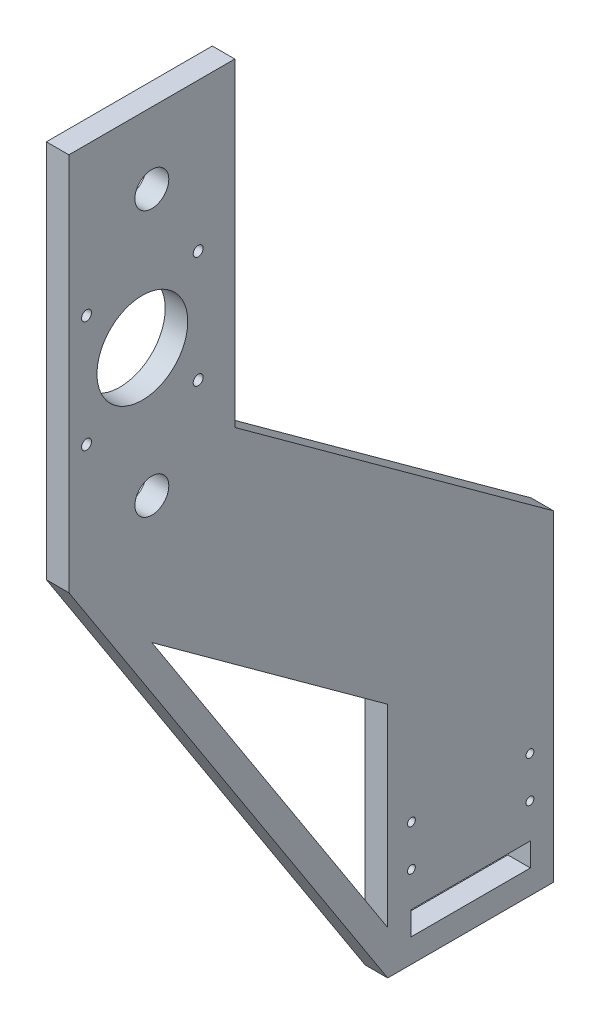
ISO-10303-21;
HEADER;
FILE_DESCRIPTION(('STEP AP214'),'2;1');
FILE_NAME('part.step','',(''),(''),'','','');
FILE_SCHEMA(('AUTOMOTIVE_DESIGN { 1 0 10303 214 1 1 1 1 }'));
ENDSEC;
DATA;
#1=APPLICATION_CONTEXT('core data for automotive mechanical design processes');
#2=APPLICATION_PROTOCOL_DEFINITION('international standard','automotive_design',2000,#1);
#3=PRODUCT_CONTEXT('',#1,'mechanical');
#4=PRODUCT('Part','Part','',(#3));
#5=PRODUCT_RELATED_PRODUCT_CATEGORY('part','',(#4));
#6=PRODUCT_DEFINITION_FORMATION('','',#4);
#7=PRODUCT_DEFINITION_CONTEXT('part definition',#1,'design');
#8=PRODUCT_DEFINITION('design','',#6,#7);
#9=PRODUCT_DEFINITION_SHAPE('','',#8);
#10=(LENGTH_UNIT() NAMED_UNIT(*) SI_UNIT(.MILLI.,.METRE.));
#11=(NAMED_UNIT(*) PLANE_ANGLE_UNIT() SI_UNIT($,.RADIAN.));
#12=(NAMED_UNIT(*) SI_UNIT($,.STERADIAN.) SOLID_ANGLE_UNIT());
#13=UNCERTAINTY_MEASURE_WITH_UNIT(LENGTH_MEASURE(1.E-05),#10,'distance_accuracy_value','');
#14=(GEOMETRIC_REPRESENTATION_CONTEXT(3) GLOBAL_UNCERTAINTY_ASSIGNED_CONTEXT((#13)) GLOBAL_UNIT_ASSIGNED_CONTEXT((#10,
#11,#12)) REPRESENTATION_CONTEXT('',''));
#15=CARTESIAN_POINT('',(0.,0.,0.));
#16=DIRECTION('',(0.,0.,1.));
#17=DIRECTION('',(1.,0.,0.));
#18=AXIS2_PLACEMENT_3D('',#15,#16,#17);
#19=CARTESIAN_POINT('',(9.5,0.,0.));
#20=DIRECTION('',(1.,0.,0.));
#21=DIRECTION('',(0.,0.,-1.));
#22=AXIS2_PLACEMENT_3D('',#19,#20,#21);
#23=PLANE('',#22);
#24=CARTESIAN_POINT('',(9.5,305.55,127.05));
#25=DIRECTION('',(1.,0.,0.));
#26=DIRECTION('',(0.,0.,-1.));
#27=AXIS2_PLACEMENT_3D('',#24,#25,#26);
#28=CIRCLE('',#27,2.09999999999999);
#29=CARTESIAN_POINT('',(9.5,305.55,124.95));
#30=VERTEX_POINT('',#29);
#31=EDGE_CURVE('E445',#30,#30,#28,.T.);
#32=ORIENTED_EDGE('',*,*,#31,.F.);
#33=EDGE_LOOP('',(#32));
#34=FACE_BOUND('',#33,.T.);
#35=CARTESIAN_POINT('',(9.5,305.55,79.95));
#36=DIRECTION('',(1.,0.,0.));
#37=DIRECTION('',(0.,0.,-1.));
#38=AXIS2_PLACEMENT_3D('',#35,#36,#37);
#39=CIRCLE('',#38,2.09999999999999);
#40=CARTESIAN_POINT('',(9.5,305.55,77.85));
#41=VERTEX_POINT('',#40);
#42=EDGE_CURVE('E449',#41,#41,#39,.T.);
#43=ORIENTED_EDGE('',*,*,#42,.F.);
#44=EDGE_LOOP('',(#43));
#45=FACE_BOUND('',#44,.T.);
#46=CARTESIAN_POINT('',(9.5,258.45,79.9499999999995));
#47=DIRECTION('',(1.,0.,0.));
#48=DIRECTION('',(0.,0.,-1.));
#49=AXIS2_PLACEMENT_3D('',#46,#47,#48);
#50=CIRCLE('',#49,2.09999999999999);
#51=CARTESIAN_POINT('',(9.5,258.45,77.8499999999995));
#52=VERTEX_POINT('',#51);
#53=EDGE_CURVE('E459',#52,#52,#50,.T.);
#54=ORIENTED_EDGE('',*,*,#53,.F.);
#55=EDGE_LOOP('',(#54));
#56=FACE_BOUND('',#55,.T.);
#57=CARTESIAN_POINT('',(9.5,258.45,127.049999999999));
#58=DIRECTION('',(1.,0.,0.));
#59=DIRECTION('',(0.,0.,-1.));
#60=AXIS2_PLACEMENT_3D('',#57,#58,#59);
#61=CIRCLE('',#60,2.09999999999999);
#62=CARTESIAN_POINT('',(9.5,258.45,124.95));
#63=VERTEX_POINT('',#62);
#64=EDGE_CURVE('E467',#63,#63,#61,.T.);
#65=ORIENTED_EDGE('',*,*,#64,.F.);
#66=EDGE_LOOP('',(#65));
#67=FACE_BOUND('',#66,.T.);
#68=CARTESIAN_POINT('',(9.5,34.7,-10.));
#69=DIRECTION('',(1.,0.,0.));
#70=DIRECTION('',(0.,0.,-1.));
#71=AXIS2_PLACEMENT_3D('',#68,#69,#70);
#72=CIRCLE('',#71,1.65);
#73=CARTESIAN_POINT('',(9.5,34.7,-11.65));
#74=VERTEX_POINT('',#73);
#75=EDGE_CURVE('E475',#74,#74,#72,.T.);
#76=ORIENTED_EDGE('',*,*,#75,.F.);
#77=EDGE_LOOP('',(#76));
#78=FACE_BOUND('',#77,.T.);
#79=CARTESIAN_POINT('',(9.5,52.,-10.));
#80=DIRECTION('',(1.,0.,0.));
#81=DIRECTION('',(0.,0.,-1.));
#82=AXIS2_PLACEMENT_3D('',#79,#80,#81);
#83=CIRCLE('',#82,1.65);
#84=CARTESIAN_POINT('',(9.5,52.,-11.65));
#85=VERTEX_POINT('',#84);
#86=EDGE_CURVE('E483',#85,#85,#83,.T.);
#87=ORIENTED_EDGE('',*,*,#86,.F.);
#88=EDGE_LOOP('',(#87));
#89=FACE_BOUND('',#88,.T.);
#90=CARTESIAN_POINT('',(9.5,52.,-60.));
#91=DIRECTION('',(1.,0.,0.));
#92=DIRECTION('',(0.,0.,-1.));
#93=AXIS2_PLACEMENT_3D('',#90,#91,#92);
#94=CIRCLE('',#93,1.65);
#95=CARTESIAN_POINT('',(9.5,52.,-61.65));
#96=VERTEX_POINT('',#95);
#97=EDGE_CURVE('E491',#96,#96,#94,.T.);
#98=ORIENTED_EDGE('',*,*,#97,.F.);
#99=EDGE_LOOP('',(#98));
#100=FACE_BOUND('',#99,.T.);
#101=CARTESIAN_POINT('',(9.5,34.7,-60.));
#102=DIRECTION('',(1.,0.,0.));
#103=DIRECTION('',(0.,0.,-1.));
#104=AXIS2_PLACEMENT_3D('',#101,#102,#103);
#105=CIRCLE('',#104,1.65);
#106=CARTESIAN_POINT('',(9.5,34.7,-61.65));
#107=VERTEX_POINT('',#106);
#108=EDGE_CURVE('E499',#107,#107,#105,.T.);
#109=ORIENTED_EDGE('',*,*,#108,.F.);
#110=EDGE_LOOP('',(#109));
#111=FACE_BOUND('',#110,.T.);
#112=CARTESIAN_POINT('',(9.5,226.,99.5));
#113=DIRECTION('',(1.,0.,0.));
#114=DIRECTION('',(0.,0.,-1.));
#115=AXIS2_PLACEMENT_3D('',#112,#113,#114);
#116=CIRCLE('',#115,7.15);
#117=CARTESIAN_POINT('',(9.5,226.,92.35));
#118=VERTEX_POINT('',#117);
#119=EDGE_CURVE('E203',#118,#118,#116,.T.);
#120=ORIENTED_EDGE('',*,*,#119,.F.);
#121=EDGE_LOOP('',(#120));
#122=FACE_BOUND('',#121,.T.);
#123=DIRECTION('',(0.,0.587779000342478,0.809021536645594));
#124=VECTOR('',#123,1.);
#125=CARTESIAN_POINT('',(9.5,172.289806741815,99.5));
#126=LINE('',#125,#124);
#127=CARTESIAN_POINT('',(9.5,100.,0.));
#128=VERTEX_POINT('',#127);
#129=CARTESIAN_POINT('',(9.5,172.289806741815,99.4999999999999));
#130=VERTEX_POINT('',#129);
#131=EDGE_CURVE('E222',#128,#130,#126,.T.);
#132=ORIENTED_EDGE('',*,*,#131,.F.);
#133=DIRECTION('',(0.,1.,0.));
#134=VECTOR('',#133,1.);
#135=CARTESIAN_POINT('',(9.5,100.,0.));
#136=LINE('',#135,#134);
#137=CARTESIAN_POINT('',(9.5,18.4162007938601,0.));
#138=VERTEX_POINT('',#137);
#139=EDGE_CURVE('E219',#138,#128,#136,.T.);
#140=ORIENTED_EDGE('',*,*,#139,.F.);
#141=DIRECTION('',(0.,-0.839732591318498,-0.543000161213163));
#142=VECTOR('',#141,1.);
#143=CARTESIAN_POINT('',(9.5,18.4162007938601,0.));
#144=LINE('',#143,#142);
#145=EDGE_CURVE('E227',#130,#138,#144,.T.);
#146=ORIENTED_EDGE('',*,*,#145,.F.);
#147=EDGE_LOOP('',(#132,#140,#146));
#148=FACE_BOUND('',#147,.T.);
#149=DIRECTION('',(0.,-0.839732591318498,-0.543000161213163));
#150=VECTOR('',#149,1.);
#151=CARTESIAN_POINT('',(9.5,208.,134.5));
#152=LINE('',#151,#150);
#153=CARTESIAN_POINT('',(9.5,208.,134.5));
#154=VERTEX_POINT('',#153);
#155=CARTESIAN_POINT('',(9.5,0.,0.));
#156=VERTEX_POINT('',#155);
#157=EDGE_CURVE('E252',#154,#156,#152,.T.);
#158=ORIENTED_EDGE('',*,*,#157,.T.);
#159=DIRECTION('',(0.,0.,-1.));
#160=VECTOR('',#159,1.);
#161=CARTESIAN_POINT('',(9.5,0.,0.));
#162=LINE('',#161,#160);
#163=CARTESIAN_POINT('',(9.5,0.,-70.));
#164=VERTEX_POINT('',#163);
#165=EDGE_CURVE('E256',#156,#164,#162,.T.);
#166=ORIENTED_EDGE('',*,*,#165,.T.);
#167=DIRECTION('',(0.,1.,0.));
#168=VECTOR('',#167,1.);
#169=CARTESIAN_POINT('',(9.5,0.,-70.));
#170=LINE('',#169,#168);
#171=CARTESIAN_POINT('',(9.5,135.667122158044,-70.));
#172=VERTEX_POINT('',#171);
#173=EDGE_CURVE('E260',#164,#172,#170,.T.);
#174=ORIENTED_EDGE('',*,*,#173,.T.);
#175=DIRECTION('',(0.,0.587779000342478,0.809021536645594));
#176=VECTOR('',#175,1.);
#177=CARTESIAN_POINT('',(9.5,135.667122158044,-70.));
#178=LINE('',#177,#176);
#179=CARTESIAN_POINT('',(9.5,233.385504135674,64.5));
#180=VERTEX_POINT('',#179);
#181=EDGE_CURVE('E263',#172,#180,#178,.T.);
#182=ORIENTED_EDGE('',*,*,#181,.T.);
#183=DIRECTION('',(0.,1.,0.));
#184=VECTOR('',#183,1.);
#185=CARTESIAN_POINT('',(9.5,233.385504135674,64.5));
#186=LINE('',#185,#184);
#187=CARTESIAN_POINT('',(9.5,368.,64.5));
#188=VERTEX_POINT('',#187);
#189=EDGE_CURVE('E266',#180,#188,#186,.T.);
#190=ORIENTED_EDGE('',*,*,#189,.T.);
#191=DIRECTION('',(0.,0.,1.));
#192=VECTOR('',#191,1.);
#193=CARTESIAN_POINT('',(9.5,368.,64.5));
#194=LINE('',#193,#192);
#195=CARTESIAN_POINT('',(9.5,368.,134.5));
#196=VERTEX_POINT('',#195);
#197=EDGE_CURVE('E269',#188,#196,#194,.T.);
#198=ORIENTED_EDGE('',*,*,#197,.T.);
#199=DIRECTION('',(0.,-1.,0.));
#200=VECTOR('',#199,1.);
#201=CARTESIAN_POINT('',(9.5,368.,134.5));
#202=LINE('',#201,#200);
#203=EDGE_CURVE('E272',#196,#154,#202,.T.);
#204=ORIENTED_EDGE('',*,*,#203,.T.);
#205=EDGE_LOOP('',(#158,#166,#174,#182,#190,#198,#204));
#206=FACE_BOUND('',#205,.T.);
#207=CARTESIAN_POINT('',(9.5,338.,99.5));
#208=DIRECTION('',(1.,0.,0.));
#209=DIRECTION('',(0.,0.,-1.));
#210=AXIS2_PLACEMENT_3D('',#207,#208,#209);
#211=CIRCLE('',#210,7.15000000000001);
#212=CARTESIAN_POINT('',(9.5,338.,92.35));
#213=VERTEX_POINT('',#212);
#214=EDGE_CURVE('E211',#213,#213,#211,.T.);
#215=ORIENTED_EDGE('',*,*,#214,.F.);
#216=EDGE_LOOP('',(#215));
#217=FACE_BOUND('',#216,.T.);
#218=CARTESIAN_POINT('',(9.5,282.,103.5));
#219=DIRECTION('',(1.,0.,0.));
#220=DIRECTION('',(0.,0.,-1.));
#221=AXIS2_PLACEMENT_3D('',#218,#219,#220);
#222=CIRCLE('',#221,19.15);
#223=CARTESIAN_POINT('',(9.5,282.,84.35));
#224=VERTEX_POINT('',#223);
#225=EDGE_CURVE('E195',#224,#224,#222,.T.);
#226=ORIENTED_EDGE('',*,*,#225,.F.);
#227=EDGE_LOOP('',(#226));
#228=FACE_BOUND('',#227,.T.);
#229=DIRECTION('',(0.,0.,-1.));
#230=VECTOR('',#229,1.);
#231=CARTESIAN_POINT('',(9.5,10.1,-9.8));
#232=LINE('',#231,#230);
#233=CARTESIAN_POINT('',(9.5,10.1,-9.8));
#234=VERTEX_POINT('',#233);
#235=CARTESIAN_POINT('',(9.5,10.1,-60.2));
#236=VERTEX_POINT('',#235);
#237=EDGE_CURVE('E154',#234,#236,#232,.T.);
#238=ORIENTED_EDGE('',*,*,#237,.F.);
#239=DIRECTION('',(0.,-1.,0.));
#240=VECTOR('',#239,1.);
#241=CARTESIAN_POINT('',(9.5,20.,-9.8));
#242=LINE('',#241,#240);
#243=CARTESIAN_POINT('',(9.5,20.,-9.8));
#244=VERTEX_POINT('',#243);
#245=EDGE_CURVE('E145',#244,#234,#242,.T.);
#246=ORIENTED_EDGE('',*,*,#245,.F.);
#247=DIRECTION('',(0.,0.,1.));
#248=VECTOR('',#247,1.);
#249=CARTESIAN_POINT('',(9.5,20.,-9.8));
#250=LINE('',#249,#248);
#251=CARTESIAN_POINT('',(9.5,20.,-60.2));
#252=VERTEX_POINT('',#251);
#253=EDGE_CURVE('E171',#252,#244,#250,.T.);
#254=ORIENTED_EDGE('',*,*,#253,.F.);
#255=DIRECTION('',(0.,1.,0.));
#256=VECTOR('',#255,1.);
#257=CARTESIAN_POINT('',(9.5,20.,-60.2));
#258=LINE('',#257,#256);
#259=EDGE_CURVE('E167',#236,#252,#258,.T.);
#260=ORIENTED_EDGE('',*,*,#259,.F.);
#261=EDGE_LOOP('',(#238,#246,#254,#260));
#262=FACE_BOUND('',#261,.T.);
#263=ADVANCED_FACE('F43',(#34,#45,#56,#67,#78,#89,#100,#111,#122,#148,#206,#217,#228,#262),#23,.T.);
#264=CARTESIAN_POINT('',(0.,0.,0.));
#265=DIRECTION('',(1.,0.,0.));
#266=DIRECTION('',(0.,0.,-1.));
#267=AXIS2_PLACEMENT_3D('',#264,#265,#266);
#268=PLANE('',#267);
#269=CARTESIAN_POINT('',(0.,305.55,127.05));
#270=DIRECTION('',(1.,0.,0.));
#271=DIRECTION('',(0.,0.,-1.));
#272=AXIS2_PLACEMENT_3D('',#269,#270,#271);
#273=CIRCLE('',#272,2.09999999999999);
#274=CARTESIAN_POINT('',(0.,305.55,124.95));
#275=VERTEX_POINT('',#274);
#276=EDGE_CURVE('E443',#275,#275,#273,.T.);
#277=ORIENTED_EDGE('',*,*,#276,.T.);
#278=EDGE_LOOP('',(#277));
#279=FACE_BOUND('',#278,.T.);
#280=CARTESIAN_POINT('',(0.,305.55,79.95));
#281=DIRECTION('',(1.,0.,0.));
#282=DIRECTION('',(0.,0.,-1.));
#283=AXIS2_PLACEMENT_3D('',#280,#281,#282);
#284=CIRCLE('',#283,2.09999999999999);
#285=CARTESIAN_POINT('',(0.,305.55,77.85));
#286=VERTEX_POINT('',#285);
#287=EDGE_CURVE('E455',#286,#286,#284,.T.);
#288=ORIENTED_EDGE('',*,*,#287,.T.);
#289=EDGE_LOOP('',(#288));
#290=FACE_BOUND('',#289,.T.);
#291=CARTESIAN_POINT('',(0.,258.45,79.9499999999995));
#292=DIRECTION('',(1.,0.,0.));
#293=DIRECTION('',(0.,0.,-1.));
#294=AXIS2_PLACEMENT_3D('',#291,#292,#293);
#295=CIRCLE('',#294,2.09999999999999);
#296=CARTESIAN_POINT('',(0.,258.45,77.8499999999995));
#297=VERTEX_POINT('',#296);
#298=EDGE_CURVE('E463',#297,#297,#295,.T.);
#299=ORIENTED_EDGE('',*,*,#298,.T.);
#300=EDGE_LOOP('',(#299));
#301=FACE_BOUND('',#300,.T.);
#302=CARTESIAN_POINT('',(0.,258.45,127.049999999999));
#303=DIRECTION('',(1.,0.,0.));
#304=DIRECTION('',(0.,0.,-1.));
#305=AXIS2_PLACEMENT_3D('',#302,#303,#304);
#306=CIRCLE('',#305,2.09999999999999);
#307=CARTESIAN_POINT('',(0.,258.45,124.95));
#308=VERTEX_POINT('',#307);
#309=EDGE_CURVE('E471',#308,#308,#306,.T.);
#310=ORIENTED_EDGE('',*,*,#309,.T.);
#311=EDGE_LOOP('',(#310));
#312=FACE_BOUND('',#311,.T.);
#313=CARTESIAN_POINT('',(0.,34.7,-10.));
#314=DIRECTION('',(1.,0.,0.));
#315=DIRECTION('',(0.,0.,-1.));
#316=AXIS2_PLACEMENT_3D('',#313,#314,#315);
#317=CIRCLE('',#316,1.65);
#318=CARTESIAN_POINT('',(0.,34.7,-11.65));
#319=VERTEX_POINT('',#318);
#320=EDGE_CURVE('E479',#319,#319,#317,.T.);
#321=ORIENTED_EDGE('',*,*,#320,.T.);
#322=EDGE_LOOP('',(#321));
#323=FACE_BOUND('',#322,.T.);
#324=CARTESIAN_POINT('',(0.,52.,-10.));
#325=DIRECTION('',(1.,0.,0.));
#326=DIRECTION('',(0.,0.,-1.));
#327=AXIS2_PLACEMENT_3D('',#324,#325,#326);
#328=CIRCLE('',#327,1.65);
#329=CARTESIAN_POINT('',(0.,52.,-11.65));
#330=VERTEX_POINT('',#329);
#331=EDGE_CURVE('E487',#330,#330,#328,.T.);
#332=ORIENTED_EDGE('',*,*,#331,.T.);
#333=EDGE_LOOP('',(#332));
#334=FACE_BOUND('',#333,.T.);
#335=CARTESIAN_POINT('',(0.,52.,-60.));
#336=DIRECTION('',(1.,0.,0.));
#337=DIRECTION('',(0.,0.,-1.));
#338=AXIS2_PLACEMENT_3D('',#335,#336,#337);
#339=CIRCLE('',#338,1.65);
#340=CARTESIAN_POINT('',(0.,52.,-61.65));
#341=VERTEX_POINT('',#340);
#342=EDGE_CURVE('E495',#341,#341,#339,.T.);
#343=ORIENTED_EDGE('',*,*,#342,.T.);
#344=EDGE_LOOP('',(#343));
#345=FACE_BOUND('',#344,.T.);
#346=CARTESIAN_POINT('',(0.,34.7,-60.));
#347=DIRECTION('',(1.,0.,0.));
#348=DIRECTION('',(0.,0.,-1.));
#349=AXIS2_PLACEMENT_3D('',#346,#347,#348);
#350=CIRCLE('',#349,1.65);
#351=CARTESIAN_POINT('',(0.,34.7,-61.65));
#352=VERTEX_POINT('',#351);
#353=EDGE_CURVE('E179',#352,#352,#350,.T.);
#354=ORIENTED_EDGE('',*,*,#353,.T.);
#355=EDGE_LOOP('',(#354));
#356=FACE_BOUND('',#355,.T.);
#357=CARTESIAN_POINT('',(0.,282.,103.5));
#358=DIRECTION('',(1.,0.,0.));
#359=DIRECTION('',(0.,0.,-1.));
#360=AXIS2_PLACEMENT_3D('',#357,#358,#359);
#361=CIRCLE('',#360,19.15);
#362=CARTESIAN_POINT('',(0.,282.,84.35));
#363=VERTEX_POINT('',#362);
#364=EDGE_CURVE('E163',#363,#363,#361,.T.);
#365=ORIENTED_EDGE('',*,*,#364,.T.);
#366=EDGE_LOOP('',(#365));
#367=FACE_BOUND('',#366,.T.);
#368=CARTESIAN_POINT('',(0.,226.,99.5));
#369=DIRECTION('',(1.,0.,0.));
#370=DIRECTION('',(0.,0.,-1.));
#371=AXIS2_PLACEMENT_3D('',#368,#369,#370);
#372=CIRCLE('',#371,7.15);
#373=CARTESIAN_POINT('',(0.,226.,92.35));
#374=VERTEX_POINT('',#373);
#375=EDGE_CURVE('E199',#374,#374,#372,.T.);
#376=ORIENTED_EDGE('',*,*,#375,.T.);
#377=EDGE_LOOP('',(#376));
#378=FACE_BOUND('',#377,.T.);
#379=CARTESIAN_POINT('',(0.,338.,99.5));
#380=DIRECTION('',(1.,0.,0.));
#381=DIRECTION('',(0.,0.,-1.));
#382=AXIS2_PLACEMENT_3D('',#379,#380,#381);
#383=CIRCLE('',#382,7.15000000000001);
#384=CARTESIAN_POINT('',(0.,338.,92.35));
#385=VERTEX_POINT('',#384);
#386=EDGE_CURVE('E207',#385,#385,#383,.T.);
#387=ORIENTED_EDGE('',*,*,#386,.T.);
#388=EDGE_LOOP('',(#387));
#389=FACE_BOUND('',#388,.T.);
#390=DIRECTION('',(0.,1.,0.));
#391=VECTOR('',#390,1.);
#392=CARTESIAN_POINT('',(0.,100.,0.));
#393=LINE('',#392,#391);
#394=CARTESIAN_POINT('',(0.,18.4162007938601,0.));
#395=VERTEX_POINT('',#394);
#396=CARTESIAN_POINT('',(0.,100.,0.));
#397=VERTEX_POINT('',#396);
#398=EDGE_CURVE('E215',#395,#397,#393,.T.);
#399=ORIENTED_EDGE('',*,*,#398,.T.);
#400=DIRECTION('',(0.,0.587779000342478,0.809021536645594));
#401=VECTOR('',#400,1.);
#402=CARTESIAN_POINT('',(0.,172.289806741815,99.5));
#403=LINE('',#402,#401);
#404=CARTESIAN_POINT('',(0.,172.289806741815,99.5));
#405=VERTEX_POINT('',#404);
#406=EDGE_CURVE('E234',#397,#405,#403,.T.);
#407=ORIENTED_EDGE('',*,*,#406,.T.);
#408=DIRECTION('',(0.,-0.839732591318498,-0.543000161213163));
#409=VECTOR('',#408,1.);
#410=CARTESIAN_POINT('',(0.,18.4162007938601,0.));
#411=LINE('',#410,#409);
#412=EDGE_CURVE('E223',#405,#395,#411,.T.);
#413=ORIENTED_EDGE('',*,*,#412,.T.);
#414=EDGE_LOOP('',(#399,#407,#413));
#415=FACE_BOUND('',#414,.T.);
#416=DIRECTION('',(0.,-0.839732591318498,-0.543000161213163));
#417=VECTOR('',#416,1.);
#418=CARTESIAN_POINT('',(0.,208.,134.5));
#419=LINE('',#418,#417);
#420=CARTESIAN_POINT('',(0.,208.,134.5));
#421=VERTEX_POINT('',#420);
#422=CARTESIAN_POINT('',(0.,0.,0.));
#423=VERTEX_POINT('',#422);
#424=EDGE_CURVE('E251',#421,#423,#419,.T.);
#425=ORIENTED_EDGE('',*,*,#424,.F.);
#426=DIRECTION('',(0.,-1.,0.));
#427=VECTOR('',#426,1.);
#428=CARTESIAN_POINT('',(0.,368.,134.5));
#429=LINE('',#428,#427);
#430=CARTESIAN_POINT('',(0.,368.,134.5));
#431=VERTEX_POINT('',#430);
#432=EDGE_CURVE('E257',#431,#421,#429,.T.);
#433=ORIENTED_EDGE('',*,*,#432,.F.);
#434=DIRECTION('',(0.,0.,1.));
#435=VECTOR('',#434,1.);
#436=CARTESIAN_POINT('',(0.,368.,64.5));
#437=LINE('',#436,#435);
#438=CARTESIAN_POINT('',(0.,368.,64.5));
#439=VERTEX_POINT('',#438);
#440=EDGE_CURVE('E291',#439,#431,#437,.T.);
#441=ORIENTED_EDGE('',*,*,#440,.F.);
#442=DIRECTION('',(0.,1.,0.));
#443=VECTOR('',#442,1.);
#444=CARTESIAN_POINT('',(0.,233.385504135674,64.5));
#445=LINE('',#444,#443);
#446=CARTESIAN_POINT('',(0.,233.385504135674,64.5));
#447=VERTEX_POINT('',#446);
#448=EDGE_CURVE('E288',#447,#439,#445,.T.);
#449=ORIENTED_EDGE('',*,*,#448,.F.);
#450=DIRECTION('',(0.,0.587779000342478,0.809021536645594));
#451=VECTOR('',#450,1.);
#452=CARTESIAN_POINT('',(0.,135.667122158044,-70.));
#453=LINE('',#452,#451);
#454=CARTESIAN_POINT('',(0.,135.667122158044,-70.));
#455=VERTEX_POINT('',#454);
#456=EDGE_CURVE('E285',#455,#447,#453,.T.);
#457=ORIENTED_EDGE('',*,*,#456,.F.);
#458=DIRECTION('',(0.,1.,0.));
#459=VECTOR('',#458,1.);
#460=CARTESIAN_POINT('',(0.,0.,-70.));
#461=LINE('',#460,#459);
#462=CARTESIAN_POINT('',(0.,0.,-70.));
#463=VERTEX_POINT('',#462);
#464=EDGE_CURVE('E282',#463,#455,#461,.T.);
#465=ORIENTED_EDGE('',*,*,#464,.F.);
#466=DIRECTION('',(0.,0.,-1.));
#467=VECTOR('',#466,1.);
#468=CARTESIAN_POINT('',(0.,0.,0.));
#469=LINE('',#468,#467);
#470=EDGE_CURVE('E279',#423,#463,#469,.T.);
#471=ORIENTED_EDGE('',*,*,#470,.F.);
#472=EDGE_LOOP('',(#425,#433,#441,#449,#457,#465,#471));
#473=FACE_BOUND('',#472,.T.);
#474=DIRECTION('',(0.,-1.,0.));
#475=VECTOR('',#474,1.);
#476=CARTESIAN_POINT('',(0.,20.,-9.8));
#477=LINE('',#476,#475);
#478=CARTESIAN_POINT('',(0.,20.,-9.8));
#479=VERTEX_POINT('',#478);
#480=CARTESIAN_POINT('',(0.,10.1,-9.8));
#481=VERTEX_POINT('',#480);
#482=EDGE_CURVE('E67',#479,#481,#477,.T.);
#483=ORIENTED_EDGE('',*,*,#482,.T.);
#484=DIRECTION('',(0.,0.,-1.));
#485=VECTOR('',#484,1.);
#486=CARTESIAN_POINT('',(0.,10.1,-9.8));
#487=LINE('',#486,#485);
#488=CARTESIAN_POINT('',(0.,10.1,-60.2));
#489=VERTEX_POINT('',#488);
#490=EDGE_CURVE('E161',#481,#489,#487,.T.);
#491=ORIENTED_EDGE('',*,*,#490,.T.);
#492=DIRECTION('',(0.,1.,0.));
#493=VECTOR('',#492,1.);
#494=CARTESIAN_POINT('',(0.,20.,-60.2));
#495=LINE('',#494,#493);
#496=CARTESIAN_POINT('',(0.,20.,-60.2));
#497=VERTEX_POINT('',#496);
#498=EDGE_CURVE('E182',#489,#497,#495,.T.);
#499=ORIENTED_EDGE('',*,*,#498,.T.);
#500=DIRECTION('',(0.,0.,1.));
#501=VECTOR('',#500,1.);
#502=CARTESIAN_POINT('',(0.,20.,-9.8));
#503=LINE('',#502,#501);
#504=EDGE_CURVE('E155',#497,#479,#503,.T.);
#505=ORIENTED_EDGE('',*,*,#504,.T.);
#506=EDGE_LOOP('',(#483,#491,#499,#505));
#507=FACE_BOUND('',#506,.T.);
#508=ADVANCED_FACE('F326',(#279,#290,#301,#312,#323,#334,#345,#356,#367,#378,#389,#415,#473,
#507),#268,.F.);
#509=CARTESIAN_POINT('',(9.5,208.,134.5));
#510=DIRECTION('',(0.,0.543000161213163,-0.839732591318498));
#511=DIRECTION('',(0.,0.839732591318498,0.543000161213163));
#512=AXIS2_PLACEMENT_3D('',#509,#510,#511);
#513=PLANE('',#512);
#514=ORIENTED_EDGE('',*,*,#424,.T.);
#515=DIRECTION('',(-1.,0.,0.));
#516=VECTOR('',#515,1.);
#517=CARTESIAN_POINT('',(9.5,0.,0.));
#518=LINE('',#517,#516);
#519=EDGE_CURVE('E11',#156,#423,#518,.T.);
#520=ORIENTED_EDGE('',*,*,#519,.F.);
#521=ORIENTED_EDGE('',*,*,#157,.F.);
#522=DIRECTION('',(-1.,0.,0.));
#523=VECTOR('',#522,1.);
#524=CARTESIAN_POINT('',(9.5,208.,134.5));
#525=LINE('',#524,#523);
#526=EDGE_CURVE('E275',#154,#421,#525,.T.);
#527=ORIENTED_EDGE('',*,*,#526,.T.);
#528=EDGE_LOOP('',(#514,#520,#521,#527));
#529=FACE_BOUND('',#528,.T.);
#530=ADVANCED_FACE('F45',(#529),#513,.F.);
#531=CARTESIAN_POINT('',(9.5,0.,0.));
#532=DIRECTION('',(0.,1.,0.));
#533=DIRECTION('',(0.,0.,1.));
#534=AXIS2_PLACEMENT_3D('',#531,#532,#533);
#535=PLANE('',#534);
#536=ORIENTED_EDGE('',*,*,#470,.T.);
#537=DIRECTION('',(-1.,0.,0.));
#538=VECTOR('',#537,1.);
#539=CARTESIAN_POINT('',(9.5,0.,-70.));
#540=LINE('',#539,#538);
#541=EDGE_CURVE('E52',#164,#463,#540,.T.);
#542=ORIENTED_EDGE('',*,*,#541,.F.);
#543=ORIENTED_EDGE('',*,*,#165,.F.);
#544=ORIENTED_EDGE('',*,*,#519,.T.);
#545=EDGE_LOOP('',(#536,#542,#543,#544));
#546=FACE_BOUND('',#545,.T.);
#547=ADVANCED_FACE('F344',(#546),#535,.F.);
#548=CARTESIAN_POINT('',(9.5,0.,-70.));
#549=DIRECTION('',(0.,0.,1.));
#550=DIRECTION('',(0.,-1.,0.));
#551=AXIS2_PLACEMENT_3D('',#548,#549,#550);
#552=PLANE('',#551);
#553=ORIENTED_EDGE('',*,*,#464,.T.);
#554=DIRECTION('',(-1.,0.,0.));
#555=VECTOR('',#554,1.);
#556=CARTESIAN_POINT('',(9.5,135.667122158044,-70.));
#557=LINE('',#556,#555);
#558=EDGE_CURVE('E311',#172,#455,#557,.T.);
#559=ORIENTED_EDGE('',*,*,#558,.F.);
#560=ORIENTED_EDGE('',*,*,#173,.F.);
#561=ORIENTED_EDGE('',*,*,#541,.T.);
#562=EDGE_LOOP('',(#553,#559,#560,#561));
#563=FACE_BOUND('',#562,.T.);
#564=ADVANCED_FACE('F320',(#563),#552,.F.);
#565=CARTESIAN_POINT('',(9.5,135.667122158044,-70.));
#566=DIRECTION('',(0.,-0.809021536645594,0.587779000342478));
#567=DIRECTION('',(0.,-0.587779000342478,-0.809021536645594));
#568=AXIS2_PLACEMENT_3D('',#565,#566,#567);
#569=PLANE('',#568);
#570=ORIENTED_EDGE('',*,*,#456,.T.);
#571=DIRECTION('',(-1.,0.,0.));
#572=VECTOR('',#571,1.);
#573=CARTESIAN_POINT('',(9.5,233.385504135674,64.5));
#574=LINE('',#573,#572);
#575=EDGE_CURVE('E307',#180,#447,#574,.T.);
#576=ORIENTED_EDGE('',*,*,#575,.F.);
#577=ORIENTED_EDGE('',*,*,#181,.F.);
#578=ORIENTED_EDGE('',*,*,#558,.T.);
#579=EDGE_LOOP('',(#570,#576,#577,#578));
#580=FACE_BOUND('',#579,.T.);
#581=ADVANCED_FACE('F332',(#580),#569,.F.);
#582=CARTESIAN_POINT('',(9.5,233.385504135674,64.5));
#583=DIRECTION('',(0.,0.,1.));
#584=DIRECTION('',(0.,-1.,0.));
#585=AXIS2_PLACEMENT_3D('',#582,#583,#584);
#586=PLANE('',#585);
#587=ORIENTED_EDGE('',*,*,#448,.T.);
#588=DIRECTION('',(-1.,0.,0.));
#589=VECTOR('',#588,1.);
#590=CARTESIAN_POINT('',(9.5,368.,64.5));
#591=LINE('',#590,#589);
#592=EDGE_CURVE('E303',#188,#439,#591,.T.);
#593=ORIENTED_EDGE('',*,*,#592,.F.);
#594=ORIENTED_EDGE('',*,*,#189,.F.);
#595=ORIENTED_EDGE('',*,*,#575,.T.);
#596=EDGE_LOOP('',(#587,#593,#594,#595));
#597=FACE_BOUND('',#596,.T.);
#598=ADVANCED_FACE('F336',(#597),#586,.F.);
#599=CARTESIAN_POINT('',(9.5,368.,64.5));
#600=DIRECTION('',(0.,-1.,0.));
#601=DIRECTION('',(0.,0.,-1.));
#602=AXIS2_PLACEMENT_3D('',#599,#600,#601);
#603=PLANE('',#602);
#604=ORIENTED_EDGE('',*,*,#440,.T.);
#605=DIRECTION('',(-1.,0.,0.));
#606=VECTOR('',#605,1.);
#607=CARTESIAN_POINT('',(9.5,368.,134.5));
#608=LINE('',#607,#606);
#609=EDGE_CURVE('E299',#196,#431,#608,.T.);
#610=ORIENTED_EDGE('',*,*,#609,.F.);
#611=ORIENTED_EDGE('',*,*,#197,.F.);
#612=ORIENTED_EDGE('',*,*,#592,.T.);
#613=EDGE_LOOP('',(#604,#610,#611,#612));
#614=FACE_BOUND('',#613,.T.);
#615=ADVANCED_FACE('F352',(#614),#603,.F.);
#616=CARTESIAN_POINT('',(9.5,368.,134.5));
#617=DIRECTION('',(0.,0.,-1.));
#618=DIRECTION('',(0.,1.,0.));
#619=AXIS2_PLACEMENT_3D('',#616,#617,#618);
#620=PLANE('',#619);
#621=ORIENTED_EDGE('',*,*,#432,.T.);
#622=ORIENTED_EDGE('',*,*,#526,.F.);
#623=ORIENTED_EDGE('',*,*,#203,.F.);
#624=ORIENTED_EDGE('',*,*,#609,.T.);
#625=EDGE_LOOP('',(#621,#622,#623,#624));
#626=FACE_BOUND('',#625,.T.);
#627=ADVANCED_FACE('F349',(#626),#620,.F.);
#628=CARTESIAN_POINT('',(9.5,100.,0.));
#629=DIRECTION('',(0.,0.,1.));
#630=DIRECTION('',(1.,0.,0.));
#631=AXIS2_PLACEMENT_3D('',#628,#629,#630);
#632=PLANE('',#631);
#633=ORIENTED_EDGE('',*,*,#398,.F.);
#634=DIRECTION('',(-1.,0.,0.));
#635=VECTOR('',#634,1.);
#636=CARTESIAN_POINT('',(9.5,18.4162007938601,0.));
#637=LINE('',#636,#635);
#638=EDGE_CURVE('E230',#138,#395,#637,.T.);
#639=ORIENTED_EDGE('',*,*,#638,.F.);
#640=ORIENTED_EDGE('',*,*,#139,.T.);
#641=DIRECTION('',(-1.,0.,0.));
#642=VECTOR('',#641,1.);
#643=CARTESIAN_POINT('',(9.5,100.,0.));
#644=LINE('',#643,#642);
#645=EDGE_CURVE('E247',#128,#397,#644,.T.);
#646=ORIENTED_EDGE('',*,*,#645,.T.);
#647=EDGE_LOOP('',(#633,#639,#640,#646));
#648=FACE_BOUND('',#647,.T.);
#649=ADVANCED_FACE('F359',(#648),#632,.T.);
#650=CARTESIAN_POINT('',(9.5,172.289806741815,99.5));
#651=DIRECTION('',(0.,-0.809021536645594,0.587779000342478));
#652=DIRECTION('',(0.,-0.587779000342478,-0.809021536645594));
#653=AXIS2_PLACEMENT_3D('',#650,#651,#652);
#654=PLANE('',#653);
#655=ORIENTED_EDGE('',*,*,#406,.F.);
#656=ORIENTED_EDGE('',*,*,#645,.F.);
#657=ORIENTED_EDGE('',*,*,#131,.T.);
#658=DIRECTION('',(-1.,0.,0.));
#659=VECTOR('',#658,1.);
#660=CARTESIAN_POINT('',(9.5,172.289806741815,99.5));
#661=LINE('',#660,#659);
#662=EDGE_CURVE('E244',#130,#405,#661,.T.);
#663=ORIENTED_EDGE('',*,*,#662,.T.);
#664=EDGE_LOOP('',(#655,#656,#657,#663));
#665=FACE_BOUND('',#664,.T.);
#666=ADVANCED_FACE('F375',(#665),#654,.T.);
#667=CARTESIAN_POINT('',(9.5,18.4162007938601,0.));
#668=DIRECTION('',(0.,0.543000161213163,-0.839732591318498));
#669=DIRECTION('',(0.,0.839732591318498,0.543000161213163));
#670=AXIS2_PLACEMENT_3D('',#667,#668,#669);
#671=PLANE('',#670);
#672=ORIENTED_EDGE('',*,*,#412,.F.);
#673=ORIENTED_EDGE('',*,*,#662,.F.);
#674=ORIENTED_EDGE('',*,*,#145,.T.);
#675=ORIENTED_EDGE('',*,*,#638,.T.);
#676=EDGE_LOOP('',(#672,#673,#674,#675));
#677=FACE_BOUND('',#676,.T.);
#678=ADVANCED_FACE('F379',(#677),#671,.T.);
#679=CARTESIAN_POINT('',(9.5,338.,99.5));
#680=DIRECTION('',(-1.,0.,0.));
#681=DIRECTION('',(0.,0.,1.));
#682=AXIS2_PLACEMENT_3D('',#679,#680,#681);
#683=CYLINDRICAL_SURFACE('',#682,7.15000000000001);
#684=ORIENTED_EDGE('',*,*,#214,.T.);
#685=EDGE_LOOP('',(#684));
#686=FACE_BOUND('',#685,.T.);
#687=ORIENTED_EDGE('',*,*,#386,.F.);
#688=EDGE_LOOP('',(#687));
#689=FACE_BOUND('',#688,.T.);
#690=ADVANCED_FACE('F383',(#686,#689),#683,.F.);
#691=CARTESIAN_POINT('',(9.5,226.,99.5));
#692=DIRECTION('',(-1.,0.,0.));
#693=DIRECTION('',(0.,0.,1.));
#694=AXIS2_PLACEMENT_3D('',#691,#692,#693);
#695=CYLINDRICAL_SURFACE('',#694,7.15);
#696=ORIENTED_EDGE('',*,*,#119,.T.);
#697=EDGE_LOOP('',(#696));
#698=FACE_BOUND('',#697,.T.);
#699=ORIENTED_EDGE('',*,*,#375,.F.);
#700=EDGE_LOOP('',(#699));
#701=FACE_BOUND('',#700,.T.);
#702=ADVANCED_FACE('F387',(#698,#701),#695,.F.);
#703=CARTESIAN_POINT('',(9.5,282.,103.5));
#704=DIRECTION('',(-1.,0.,0.));
#705=DIRECTION('',(0.,0.,1.));
#706=AXIS2_PLACEMENT_3D('',#703,#704,#705);
#707=CYLINDRICAL_SURFACE('',#706,19.15);
#708=ORIENTED_EDGE('',*,*,#225,.T.);
#709=EDGE_LOOP('',(#708));
#710=FACE_BOUND('',#709,.T.);
#711=ORIENTED_EDGE('',*,*,#364,.F.);
#712=EDGE_LOOP('',(#711));
#713=FACE_BOUND('',#712,.T.);
#714=ADVANCED_FACE('F391',(#710,#713),#707,.F.);
#715=CARTESIAN_POINT('',(9.5,20.,-9.8));
#716=DIRECTION('',(0.,0.,-1.));
#717=DIRECTION('',(-1.,0.,0.));
#718=AXIS2_PLACEMENT_3D('',#715,#716,#717);
#719=PLANE('',#718);
#720=ORIENTED_EDGE('',*,*,#482,.F.);
#721=DIRECTION('',(-1.,0.,0.));
#722=VECTOR('',#721,1.);
#723=CARTESIAN_POINT('',(9.5,20.,-9.8));
#724=LINE('',#723,#722);
#725=EDGE_CURVE('E149',#244,#479,#724,.T.);
#726=ORIENTED_EDGE('',*,*,#725,.F.);
#727=ORIENTED_EDGE('',*,*,#245,.T.);
#728=DIRECTION('',(-1.,0.,0.));
#729=VECTOR('',#728,1.);
#730=CARTESIAN_POINT('',(9.5,10.1,-9.8));
#731=LINE('',#730,#729);
#732=EDGE_CURVE('E148',#234,#481,#731,.T.);
#733=ORIENTED_EDGE('',*,*,#732,.T.);
#734=EDGE_LOOP('',(#720,#726,#727,#733));
#735=FACE_BOUND('',#734,.T.);
#736=ADVANCED_FACE('F147',(#735),#719,.T.);
#737=CARTESIAN_POINT('',(9.5,10.1,-9.8));
#738=DIRECTION('',(0.,1.,0.));
#739=DIRECTION('',(0.,0.,1.));
#740=AXIS2_PLACEMENT_3D('',#737,#738,#739);
#741=PLANE('',#740);
#742=ORIENTED_EDGE('',*,*,#490,.F.);
#743=ORIENTED_EDGE('',*,*,#732,.F.);
#744=ORIENTED_EDGE('',*,*,#237,.T.);
#745=DIRECTION('',(-1.,0.,0.));
#746=VECTOR('',#745,1.);
#747=CARTESIAN_POINT('',(9.5,10.1,-60.2));
#748=LINE('',#747,#746);
#749=EDGE_CURVE('E164',#236,#489,#748,.T.);
#750=ORIENTED_EDGE('',*,*,#749,.T.);
#751=EDGE_LOOP('',(#742,#743,#744,#750));
#752=FACE_BOUND('',#751,.T.);
#753=ADVANCED_FACE('F158',(#752),#741,.T.);
#754=CARTESIAN_POINT('',(9.5,20.,-60.2));
#755=DIRECTION('',(0.,0.,1.));
#756=DIRECTION('',(1.,0.,0.));
#757=AXIS2_PLACEMENT_3D('',#754,#755,#756);
#758=PLANE('',#757);
#759=ORIENTED_EDGE('',*,*,#498,.F.);
#760=ORIENTED_EDGE('',*,*,#749,.F.);
#761=ORIENTED_EDGE('',*,*,#259,.T.);
#762=DIRECTION('',(-1.,0.,0.));
#763=VECTOR('',#762,1.);
#764=CARTESIAN_POINT('',(9.5,20.,-60.2));
#765=LINE('',#764,#763);
#766=EDGE_CURVE('E59',#252,#497,#765,.T.);
#767=ORIENTED_EDGE('',*,*,#766,.T.);
#768=EDGE_LOOP('',(#759,#760,#761,#767));
#769=FACE_BOUND('',#768,.T.);
#770=ADVANCED_FACE('F400',(#769),#758,.T.);
#771=CARTESIAN_POINT('',(9.5,20.,-9.8));
#772=DIRECTION('',(0.,-1.,0.));
#773=DIRECTION('',(0.,0.,-1.));
#774=AXIS2_PLACEMENT_3D('',#771,#772,#773);
#775=PLANE('',#774);
#776=ORIENTED_EDGE('',*,*,#504,.F.);
#777=ORIENTED_EDGE('',*,*,#766,.F.);
#778=ORIENTED_EDGE('',*,*,#253,.T.);
#779=ORIENTED_EDGE('',*,*,#725,.T.);
#780=EDGE_LOOP('',(#776,#777,#778,#779));
#781=FACE_BOUND('',#780,.T.);
#782=ADVANCED_FACE('F403',(#781),#775,.T.);
#783=CARTESIAN_POINT('',(9.5,34.7,-60.));
#784=DIRECTION('',(1.,0.,0.));
#785=DIRECTION('',(0.,0.,-1.));
#786=AXIS2_PLACEMENT_3D('',#783,#784,#785);
#787=CYLINDRICAL_SURFACE('',#786,1.65);
#788=ORIENTED_EDGE('',*,*,#353,.F.);
#789=EDGE_LOOP('',(#788));
#790=FACE_BOUND('',#789,.T.);
#791=ORIENTED_EDGE('',*,*,#108,.T.);
#792=EDGE_LOOP('',(#791));
#793=FACE_BOUND('',#792,.T.);
#794=ADVANCED_FACE('F407',(#790,#793),#787,.F.);
#795=CARTESIAN_POINT('',(9.5,52.,-60.));
#796=DIRECTION('',(1.,0.,0.));
#797=DIRECTION('',(0.,0.,-1.));
#798=AXIS2_PLACEMENT_3D('',#795,#796,#797);
#799=CYLINDRICAL_SURFACE('',#798,1.65);
#800=ORIENTED_EDGE('',*,*,#342,.F.);
#801=EDGE_LOOP('',(#800));
#802=FACE_BOUND('',#801,.T.);
#803=ORIENTED_EDGE('',*,*,#97,.T.);
#804=EDGE_LOOP('',(#803));
#805=FACE_BOUND('',#804,.T.);
#806=ADVANCED_FACE('F410',(#802,#805),#799,.F.);
#807=CARTESIAN_POINT('',(9.5,52.,-10.));
#808=DIRECTION('',(1.,0.,0.));
#809=DIRECTION('',(0.,0.,-1.));
#810=AXIS2_PLACEMENT_3D('',#807,#808,#809);
#811=CYLINDRICAL_SURFACE('',#810,1.65);
#812=ORIENTED_EDGE('',*,*,#331,.F.);
#813=EDGE_LOOP('',(#812));
#814=FACE_BOUND('',#813,.T.);
#815=ORIENTED_EDGE('',*,*,#86,.T.);
#816=EDGE_LOOP('',(#815));
#817=FACE_BOUND('',#816,.T.);
#818=ADVANCED_FACE('F414',(#814,#817),#811,.F.);
#819=CARTESIAN_POINT('',(9.5,34.7,-10.));
#820=DIRECTION('',(1.,0.,0.));
#821=DIRECTION('',(0.,0.,-1.));
#822=AXIS2_PLACEMENT_3D('',#819,#820,#821);
#823=CYLINDRICAL_SURFACE('',#822,1.65);
#824=ORIENTED_EDGE('',*,*,#320,.F.);
#825=EDGE_LOOP('',(#824));
#826=FACE_BOUND('',#825,.T.);
#827=ORIENTED_EDGE('',*,*,#75,.T.);
#828=EDGE_LOOP('',(#827));
#829=FACE_BOUND('',#828,.T.);
#830=ADVANCED_FACE('F418',(#826,#829),#823,.F.);
#831=CARTESIAN_POINT('',(9.5,258.45,127.049999999999));
#832=DIRECTION('',(1.,0.,0.));
#833=DIRECTION('',(0.,0.,-1.));
#834=AXIS2_PLACEMENT_3D('',#831,#832,#833);
#835=CYLINDRICAL_SURFACE('',#834,2.09999999999999);
#836=ORIENTED_EDGE('',*,*,#309,.F.);
#837=EDGE_LOOP('',(#836));
#838=FACE_BOUND('',#837,.T.);
#839=ORIENTED_EDGE('',*,*,#64,.T.);
#840=EDGE_LOOP('',(#839));
#841=FACE_BOUND('',#840,.T.);
#842=ADVANCED_FACE('F422',(#838,#841),#835,.F.);
#843=CARTESIAN_POINT('',(9.5,258.45,79.9499999999995));
#844=DIRECTION('',(1.,0.,0.));
#845=DIRECTION('',(0.,0.,-1.));
#846=AXIS2_PLACEMENT_3D('',#843,#844,#845);
#847=CYLINDRICAL_SURFACE('',#846,2.09999999999999);
#848=ORIENTED_EDGE('',*,*,#298,.F.);
#849=EDGE_LOOP('',(#848));
#850=FACE_BOUND('',#849,.T.);
#851=ORIENTED_EDGE('',*,*,#53,.T.);
#852=EDGE_LOOP('',(#851));
#853=FACE_BOUND('',#852,.T.);
#854=ADVANCED_FACE('F426',(#850,#853),#847,.F.);
#855=CARTESIAN_POINT('',(9.5,305.55,79.95));
#856=DIRECTION('',(1.,0.,0.));
#857=DIRECTION('',(0.,0.,-1.));
#858=AXIS2_PLACEMENT_3D('',#855,#856,#857);
#859=CYLINDRICAL_SURFACE('',#858,2.09999999999999);
#860=ORIENTED_EDGE('',*,*,#287,.F.);
#861=EDGE_LOOP('',(#860));
#862=FACE_BOUND('',#861,.T.);
#863=ORIENTED_EDGE('',*,*,#42,.T.);
#864=EDGE_LOOP('',(#863));
#865=FACE_BOUND('',#864,.T.);
#866=ADVANCED_FACE('F430',(#862,#865),#859,.F.);
#867=CARTESIAN_POINT('',(9.5,305.55,127.05));
#868=DIRECTION('',(1.,0.,0.));
#869=DIRECTION('',(0.,0.,-1.));
#870=AXIS2_PLACEMENT_3D('',#867,#868,#869);
#871=CYLINDRICAL_SURFACE('',#870,2.09999999999999);
#872=ORIENTED_EDGE('',*,*,#276,.F.);
#873=EDGE_LOOP('',(#872));
#874=FACE_BOUND('',#873,.T.);
#875=ORIENTED_EDGE('',*,*,#31,.T.);
#876=EDGE_LOOP('',(#875));
#877=FACE_BOUND('',#876,.T.);
#878=ADVANCED_FACE('F434',(#874,#877),#871,.F.);
#879=CLOSED_SHELL('',(#263,#508,#530,#547,#564,#581,#598,#615,#627,#649,#666,#678,#690,#702,
#714,#736,#753,#770,#782,#794,#806,#818,#830,#842,#854,#866,#878));
#880=MANIFOLD_SOLID_BREP('B2',#879);
#881=ADVANCED_BREP_SHAPE_REPRESENTATION('',(#18,#880),#14);
#882=SHAPE_DEFINITION_REPRESENTATION(#9,#881);
ENDSEC;
END-ISO-10303-21;
